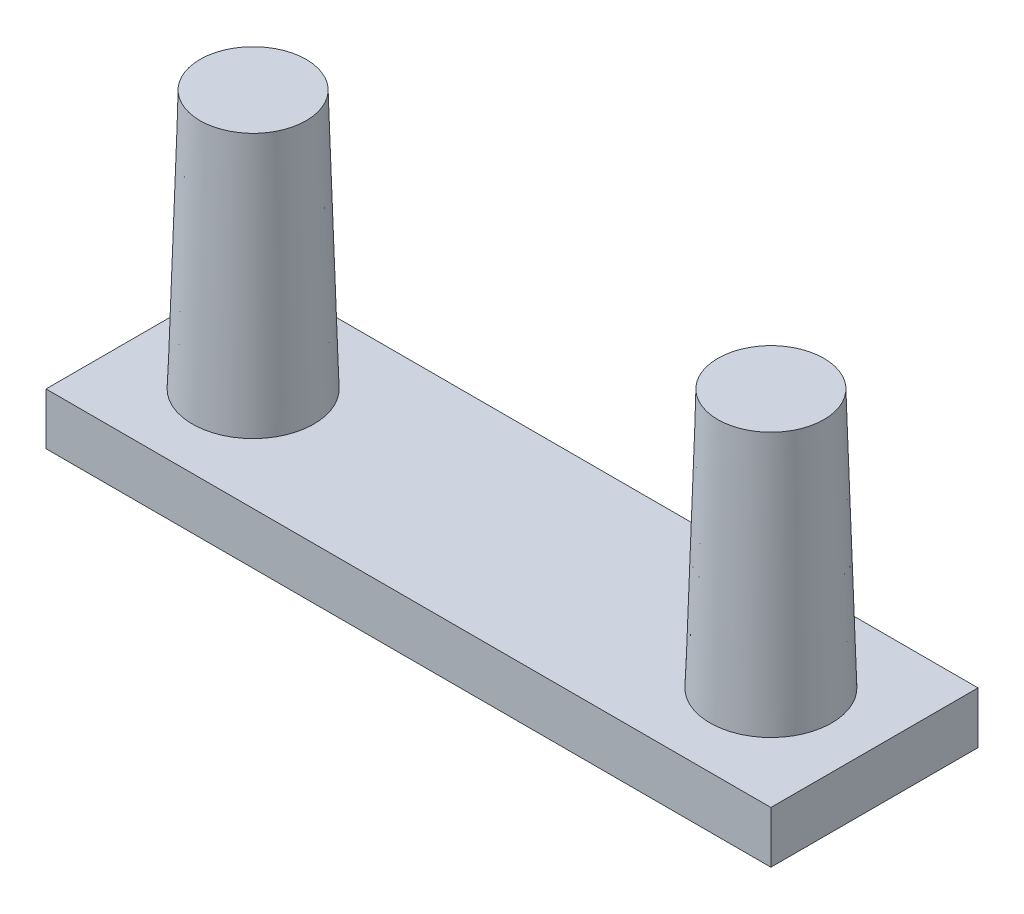
ISO-10303-21;
HEADER;
FILE_DESCRIPTION(('STEP AP214'),'2;1');
FILE_NAME('part.step','',(''),(''),'','','');
FILE_SCHEMA(('AUTOMOTIVE_DESIGN { 1 0 10303 214 1 1 1 1 }'));
ENDSEC;
DATA;
#1=APPLICATION_CONTEXT('core data for automotive mechanical design processes');
#2=APPLICATION_PROTOCOL_DEFINITION('international standard','automotive_design',2000,#1);
#3=PRODUCT_CONTEXT('',#1,'mechanical');
#4=PRODUCT('Part','Part','',(#3));
#5=PRODUCT_RELATED_PRODUCT_CATEGORY('part','',(#4));
#6=PRODUCT_DEFINITION_FORMATION('','',#4);
#7=PRODUCT_DEFINITION_CONTEXT('part definition',#1,'design');
#8=PRODUCT_DEFINITION('design','',#6,#7);
#9=PRODUCT_DEFINITION_SHAPE('','',#8);
#10=(LENGTH_UNIT() NAMED_UNIT(*) SI_UNIT(.MILLI.,.METRE.));
#11=(NAMED_UNIT(*) PLANE_ANGLE_UNIT() SI_UNIT($,.RADIAN.));
#12=(NAMED_UNIT(*) SI_UNIT($,.STERADIAN.) SOLID_ANGLE_UNIT());
#13=UNCERTAINTY_MEASURE_WITH_UNIT(LENGTH_MEASURE(1.E-05),#10,'distance_accuracy_value','');
#14=(GEOMETRIC_REPRESENTATION_CONTEXT(3) GLOBAL_UNCERTAINTY_ASSIGNED_CONTEXT((#13)) GLOBAL_UNIT_ASSIGNED_CONTEXT((#10,
#11,#12)) REPRESENTATION_CONTEXT('',''));
#15=CARTESIAN_POINT('',(0.,0.,0.));
#16=DIRECTION('',(0.,0.,1.));
#17=DIRECTION('',(1.,0.,0.));
#18=AXIS2_PLACEMENT_3D('',#15,#16,#17);
#19=CARTESIAN_POINT('',(14.,2.,4.));
#20=DIRECTION('',(-1.,0.,0.));
#21=DIRECTION('',(0.,0.,1.));
#22=AXIS2_PLACEMENT_3D('',#19,#20,#21);
#23=PLANE('',#22);
#24=DIRECTION('',(0.,0.,-1.));
#25=VECTOR('',#24,1.);
#26=CARTESIAN_POINT('',(14.,0.,4.));
#27=LINE('',#26,#25);
#28=CARTESIAN_POINT('',(14.,0.,4.));
#29=VERTEX_POINT('',#28);
#30=CARTESIAN_POINT('',(14.,0.,-4.));
#31=VERTEX_POINT('',#30);
#32=EDGE_CURVE('E110',#29,#31,#27,.T.);
#33=ORIENTED_EDGE('',*,*,#32,.T.);
#34=DIRECTION('',(0.,-1.,0.));
#35=VECTOR('',#34,1.);
#36=CARTESIAN_POINT('',(14.,2.,-4.));
#37=LINE('',#36,#35);
#38=CARTESIAN_POINT('',(14.,2.,-4.));
#39=VERTEX_POINT('',#38);
#40=EDGE_CURVE('E101',#39,#31,#37,.T.);
#41=ORIENTED_EDGE('',*,*,#40,.F.);
#42=DIRECTION('',(0.,0.,-1.));
#43=VECTOR('',#42,1.);
#44=CARTESIAN_POINT('',(14.,2.,4.));
#45=LINE('',#44,#43);
#46=CARTESIAN_POINT('',(14.,2.,4.));
#47=VERTEX_POINT('',#46);
#48=EDGE_CURVE('E95',#47,#39,#45,.T.);
#49=ORIENTED_EDGE('',*,*,#48,.F.);
#50=DIRECTION('',(0.,-1.,0.));
#51=VECTOR('',#50,1.);
#52=CARTESIAN_POINT('',(14.,2.,4.));
#53=LINE('',#52,#51);
#54=EDGE_CURVE('E106',#47,#29,#53,.T.);
#55=ORIENTED_EDGE('',*,*,#54,.T.);
#56=EDGE_LOOP('',(#33,#41,#49,#55));
#57=FACE_BOUND('',#56,.T.);
#58=ADVANCED_FACE('F41',(#57),#23,.F.);
#59=CARTESIAN_POINT('',(-14.,2.,-4.));
#60=DIRECTION('',(0.,0.,1.));
#61=DIRECTION('',(1.,0.,0.));
#62=AXIS2_PLACEMENT_3D('',#59,#60,#61);
#63=PLANE('',#62);
#64=DIRECTION('',(-1.,0.,0.));
#65=VECTOR('',#64,1.);
#66=CARTESIAN_POINT('',(-14.,0.,-4.));
#67=LINE('',#66,#65);
#68=CARTESIAN_POINT('',(-14.,0.,-4.));
#69=VERTEX_POINT('',#68);
#70=EDGE_CURVE('E100',#31,#69,#67,.T.);
#71=ORIENTED_EDGE('',*,*,#70,.T.);
#72=DIRECTION('',(0.,-1.,0.));
#73=VECTOR('',#72,1.);
#74=CARTESIAN_POINT('',(-14.,2.,-4.));
#75=LINE('',#74,#73);
#76=CARTESIAN_POINT('',(-14.,2.,-4.));
#77=VERTEX_POINT('',#76);
#78=EDGE_CURVE('E98',#77,#69,#75,.T.);
#79=ORIENTED_EDGE('',*,*,#78,.F.);
#80=DIRECTION('',(-1.,0.,0.));
#81=VECTOR('',#80,1.);
#82=CARTESIAN_POINT('',(-14.,2.,-4.));
#83=LINE('',#82,#81);
#84=EDGE_CURVE('E90',#39,#77,#83,.T.);
#85=ORIENTED_EDGE('',*,*,#84,.F.);
#86=ORIENTED_EDGE('',*,*,#40,.T.);
#87=EDGE_LOOP('',(#71,#79,#85,#86));
#88=FACE_BOUND('',#87,.T.);
#89=ADVANCED_FACE('F99',(#88),#63,.F.);
#90=CARTESIAN_POINT('',(-14.,2.,4.));
#91=DIRECTION('',(1.,0.,0.));
#92=DIRECTION('',(0.,0.,-1.));
#93=AXIS2_PLACEMENT_3D('',#90,#91,#92);
#94=PLANE('',#93);
#95=DIRECTION('',(0.,0.,1.));
#96=VECTOR('',#95,1.);
#97=CARTESIAN_POINT('',(-14.,0.,4.));
#98=LINE('',#97,#96);
#99=CARTESIAN_POINT('',(-14.,0.,4.));
#100=VERTEX_POINT('',#99);
#101=EDGE_CURVE('E76',#69,#100,#98,.T.);
#102=ORIENTED_EDGE('',*,*,#101,.T.);
#103=DIRECTION('',(0.,-1.,0.));
#104=VECTOR('',#103,1.);
#105=CARTESIAN_POINT('',(-14.,2.,4.));
#106=LINE('',#105,#104);
#107=CARTESIAN_POINT('',(-14.,2.,4.));
#108=VERTEX_POINT('',#107);
#109=EDGE_CURVE('E102',#108,#100,#106,.T.);
#110=ORIENTED_EDGE('',*,*,#109,.F.);
#111=DIRECTION('',(0.,0.,1.));
#112=VECTOR('',#111,1.);
#113=CARTESIAN_POINT('',(-14.,2.,4.));
#114=LINE('',#113,#112);
#115=EDGE_CURVE('E93',#77,#108,#114,.T.);
#116=ORIENTED_EDGE('',*,*,#115,.F.);
#117=ORIENTED_EDGE('',*,*,#78,.T.);
#118=EDGE_LOOP('',(#102,#110,#116,#117));
#119=FACE_BOUND('',#118,.T.);
#120=ADVANCED_FACE('F104',(#119),#94,.F.);
#121=CARTESIAN_POINT('',(-14.,2.,4.));
#122=DIRECTION('',(0.,0.,-1.));
#123=DIRECTION('',(-1.,0.,0.));
#124=AXIS2_PLACEMENT_3D('',#121,#122,#123);
#125=PLANE('',#124);
#126=DIRECTION('',(1.,0.,0.));
#127=VECTOR('',#126,1.);
#128=CARTESIAN_POINT('',(-14.,0.,4.));
#129=LINE('',#128,#127);
#130=EDGE_CURVE('E82',#100,#29,#129,.T.);
#131=ORIENTED_EDGE('',*,*,#130,.T.);
#132=ORIENTED_EDGE('',*,*,#54,.F.);
#133=DIRECTION('',(1.,0.,0.));
#134=VECTOR('',#133,1.);
#135=CARTESIAN_POINT('',(-14.,2.,4.));
#136=LINE('',#135,#134);
#137=EDGE_CURVE('E59',#108,#47,#136,.T.);
#138=ORIENTED_EDGE('',*,*,#137,.F.);
#139=ORIENTED_EDGE('',*,*,#109,.T.);
#140=EDGE_LOOP('',(#131,#132,#138,#139));
#141=FACE_BOUND('',#140,.T.);
#142=ADVANCED_FACE('F132',(#141),#125,.F.);
#143=CARTESIAN_POINT('',(0.,2.,0.));
#144=DIRECTION('',(0.,-1.,0.));
#145=DIRECTION('',(0.,0.,-1.));
#146=AXIS2_PLACEMENT_3D('',#143,#144,#145);
#147=PLANE('',#146);
#148=CARTESIAN_POINT('',(-10.,2.,0.));
#149=DIRECTION('',(0.,-1.,0.));
#150=DIRECTION('',(0.,0.,-1.));
#151=AXIS2_PLACEMENT_3D('',#148,#149,#150);
#152=CIRCLE('',#151,2.35);
#153=CARTESIAN_POINT('',(-10.,2.,-2.35));
#154=VERTEX_POINT('',#153);
#155=EDGE_CURVE('E51',#154,#154,#152,.F.);
#156=ORIENTED_EDGE('',*,*,#155,.F.);
#157=EDGE_LOOP('',(#156));
#158=FACE_BOUND('',#157,.T.);
#159=CARTESIAN_POINT('',(10.,2.,0.));
#160=DIRECTION('',(0.,-1.,0.));
#161=DIRECTION('',(0.,0.,-1.));
#162=AXIS2_PLACEMENT_3D('',#159,#160,#161);
#163=CIRCLE('',#162,2.35);
#164=CARTESIAN_POINT('',(10.,2.,-2.35));
#165=VERTEX_POINT('',#164);
#166=EDGE_CURVE('E119',#165,#165,#163,.F.);
#167=ORIENTED_EDGE('',*,*,#166,.F.);
#168=EDGE_LOOP('',(#167));
#169=FACE_BOUND('',#168,.T.);
#170=ORIENTED_EDGE('',*,*,#48,.T.);
#171=ORIENTED_EDGE('',*,*,#84,.T.);
#172=ORIENTED_EDGE('',*,*,#115,.T.);
#173=ORIENTED_EDGE('',*,*,#137,.T.);
#174=EDGE_LOOP('',(#170,#171,#172,#173));
#175=FACE_BOUND('',#174,.T.);
#176=ADVANCED_FACE('F91',(#158,#169,#175),#147,.F.);
#177=CARTESIAN_POINT('',(0.,0.,0.));
#178=DIRECTION('',(0.,-1.,0.));
#179=DIRECTION('',(0.,0.,-1.));
#180=AXIS2_PLACEMENT_3D('',#177,#178,#179);
#181=PLANE('',#180);
#182=ORIENTED_EDGE('',*,*,#32,.F.);
#183=ORIENTED_EDGE('',*,*,#130,.F.);
#184=ORIENTED_EDGE('',*,*,#101,.F.);
#185=ORIENTED_EDGE('',*,*,#70,.F.);
#186=EDGE_LOOP('',(#182,#183,#184,#185));
#187=FACE_BOUND('',#186,.T.);
#188=ADVANCED_FACE('F131',(#187),#181,.T.);
#189=CARTESIAN_POINT('',(0.,12.,0.));
#190=DIRECTION('',(0.,1.,0.));
#191=DIRECTION('',(0.,0.,1.));
#192=AXIS2_PLACEMENT_3D('',#189,#190,#191);
#193=PLANE('',#192);
#194=CARTESIAN_POINT('',(10.,12.,0.));
#195=DIRECTION('',(0.,1.,0.));
#196=DIRECTION('',(0.,0.,1.));
#197=AXIS2_PLACEMENT_3D('',#194,#195,#196);
#198=CIRCLE('',#197,2.05000000000007);
#199=CARTESIAN_POINT('',(10.,12.,2.05000000000007));
#200=VERTEX_POINT('',#199);
#201=EDGE_CURVE('E122',#200,#200,#198,.T.);
#202=ORIENTED_EDGE('',*,*,#201,.T.);
#203=EDGE_LOOP('',(#202));
#204=FACE_BOUND('',#203,.T.);
#205=ADVANCED_FACE('F140',(#204),#193,.T.);
#206=CARTESIAN_POINT('',(10.,12.,0.));
#207=DIRECTION('',(0.,-1.,0.));
#208=DIRECTION('',(0.,0.,-1.));
#209=AXIS2_PLACEMENT_3D('',#206,#207,#208);
#210=CONICAL_SURFACE('',#209,2.05000000000007,0.0299910048568744);
#211=ORIENTED_EDGE('',*,*,#166,.T.);
#212=EDGE_LOOP('',(#211));
#213=FACE_BOUND('',#212,.T.);
#214=ORIENTED_EDGE('',*,*,#201,.F.);
#215=EDGE_LOOP('',(#214));
#216=FACE_BOUND('',#215,.T.);
#217=ADVANCED_FACE('F136',(#213,#216),#210,.T.);
#218=CARTESIAN_POINT('',(-20.,12.,0.));
#219=DIRECTION('',(0.,1.,0.));
#220=DIRECTION('',(0.,0.,1.));
#221=AXIS2_PLACEMENT_3D('',#218,#219,#220);
#222=PLANE('',#221);
#223=CARTESIAN_POINT('',(-10.,12.,0.));
#224=DIRECTION('',(0.,1.,0.));
#225=DIRECTION('',(0.,0.,1.));
#226=AXIS2_PLACEMENT_3D('',#223,#224,#225);
#227=CIRCLE('',#226,2.05000000000007);
#228=CARTESIAN_POINT('',(-10.,12.,2.05000000000007));
#229=VERTEX_POINT('',#228);
#230=EDGE_CURVE('E11',#229,#229,#227,.T.);
#231=ORIENTED_EDGE('',*,*,#230,.T.);
#232=EDGE_LOOP('',(#231));
#233=FACE_BOUND('',#232,.T.);
#234=ADVANCED_FACE('F139',(#233),#222,.T.);
#235=CARTESIAN_POINT('',(-10.,12.,0.));
#236=DIRECTION('',(0.,-1.,0.));
#237=DIRECTION('',(0.,0.,-1.));
#238=AXIS2_PLACEMENT_3D('',#235,#236,#237);
#239=CONICAL_SURFACE('',#238,2.05000000000007,0.0299910048568744);
#240=ORIENTED_EDGE('',*,*,#155,.T.);
#241=EDGE_LOOP('',(#240));
#242=FACE_BOUND('',#241,.T.);
#243=ORIENTED_EDGE('',*,*,#230,.F.);
#244=EDGE_LOOP('',(#243));
#245=FACE_BOUND('',#244,.T.);
#246=ADVANCED_FACE('F44',(#242,#245),#239,.T.);
#247=CLOSED_SHELL('',(#58,#89,#120,#142,#176,#188,#205,#217,#234,#246));
#248=MANIFOLD_SOLID_BREP('B2',#247);
#249=ADVANCED_BREP_SHAPE_REPRESENTATION('',(#18,#248),#14);
#250=SHAPE_DEFINITION_REPRESENTATION(#9,#249);
ENDSEC;
END-ISO-10303-21;
